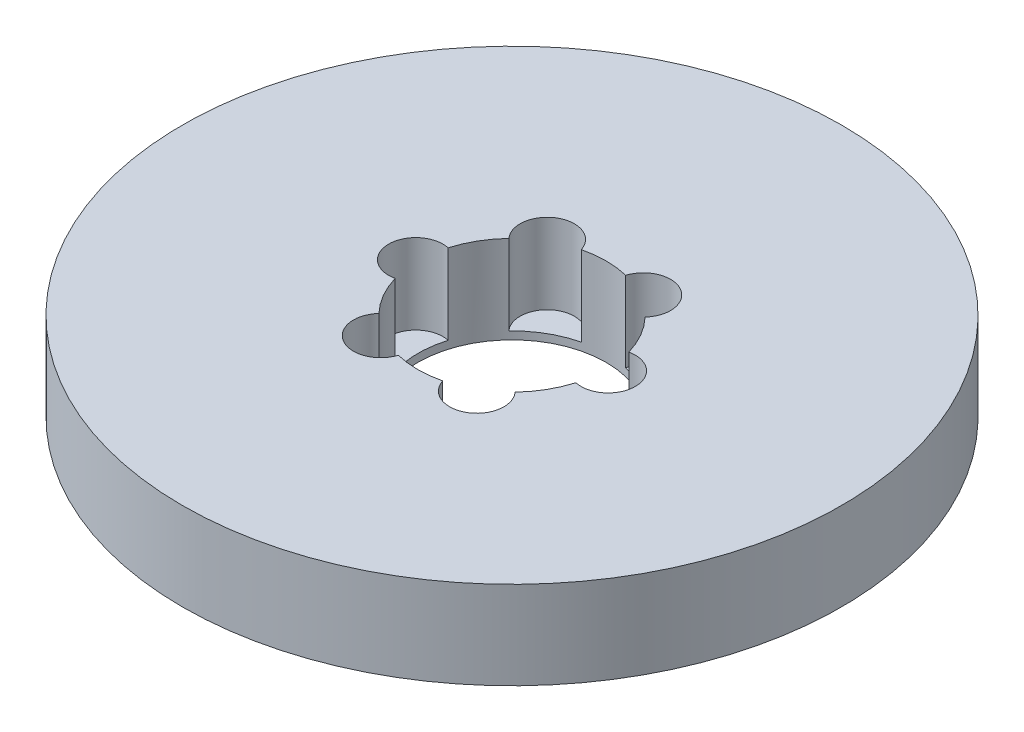
ISO-10303-21;
HEADER;
FILE_DESCRIPTION(('STEP AP214'),'2;1');
FILE_NAME('part.step','',(''),(''),'','','');
FILE_SCHEMA(('AUTOMOTIVE_DESIGN { 1 0 10303 214 1 1 1 1 }'));
ENDSEC;
DATA;
#1=APPLICATION_CONTEXT('core data for automotive mechanical design processes');
#2=APPLICATION_PROTOCOL_DEFINITION('international standard','automotive_design',2000,#1);
#3=PRODUCT_CONTEXT('',#1,'mechanical');
#4=PRODUCT('Part','Part','',(#3));
#5=PRODUCT_RELATED_PRODUCT_CATEGORY('part','',(#4));
#6=PRODUCT_DEFINITION_FORMATION('','',#4);
#7=PRODUCT_DEFINITION_CONTEXT('part definition',#1,'design');
#8=PRODUCT_DEFINITION('design','',#6,#7);
#9=PRODUCT_DEFINITION_SHAPE('','',#8);
#10=(LENGTH_UNIT() NAMED_UNIT(*) SI_UNIT(.MILLI.,.METRE.));
#11=(NAMED_UNIT(*) PLANE_ANGLE_UNIT() SI_UNIT($,.RADIAN.));
#12=(NAMED_UNIT(*) SI_UNIT($,.STERADIAN.) SOLID_ANGLE_UNIT());
#13=UNCERTAINTY_MEASURE_WITH_UNIT(LENGTH_MEASURE(1.E-05),#10,'distance_accuracy_value','');
#14=(GEOMETRIC_REPRESENTATION_CONTEXT(3) GLOBAL_UNCERTAINTY_ASSIGNED_CONTEXT((#13)) GLOBAL_UNIT_ASSIGNED_CONTEXT((#10,
#11,#12)) REPRESENTATION_CONTEXT('',''));
#15=CARTESIAN_POINT('',(0.,0.,0.));
#16=DIRECTION('',(0.,0.,1.));
#17=DIRECTION('',(1.,0.,0.));
#18=AXIS2_PLACEMENT_3D('',#15,#16,#17);
#19=CARTESIAN_POINT('',(0.,14.,0.));
#20=DIRECTION('',(0.,-1.,0.));
#21=DIRECTION('',(0.,0.,-1.));
#22=AXIS2_PLACEMENT_3D('',#19,#20,#21);
#23=CYLINDRICAL_SURFACE('',#22,52.5);
#24=CARTESIAN_POINT('',(0.,14.,0.));
#25=DIRECTION('',(0.,1.,0.));
#26=DIRECTION('',(0.,0.,1.));
#27=AXIS2_PLACEMENT_3D('',#24,#25,#26);
#28=CIRCLE('',#27,52.5);
#29=CARTESIAN_POINT('',(0.,14.,52.5));
#30=VERTEX_POINT('',#29);
#31=EDGE_CURVE('E171',#30,#30,#28,.T.);
#32=ORIENTED_EDGE('',*,*,#31,.F.);
#33=EDGE_LOOP('',(#32));
#34=FACE_BOUND('',#33,.T.);
#35=CARTESIAN_POINT('',(0.,0.,0.));
#36=DIRECTION('',(0.,1.,0.));
#37=DIRECTION('',(0.,0.,1.));
#38=AXIS2_PLACEMENT_3D('',#35,#36,#37);
#39=CIRCLE('',#38,52.5);
#40=CARTESIAN_POINT('',(0.,0.,52.5));
#41=VERTEX_POINT('',#40);
#42=EDGE_CURVE('E157',#41,#41,#39,.T.);
#43=ORIENTED_EDGE('',*,*,#42,.T.);
#44=EDGE_LOOP('',(#43));
#45=FACE_BOUND('',#44,.T.);
#46=ADVANCED_FACE('F39',(#34,#45),#23,.T.);
#47=CARTESIAN_POINT('',(0.,14.,0.));
#48=DIRECTION('',(0.,1.,0.));
#49=DIRECTION('',(0.,0.,1.));
#50=AXIS2_PLACEMENT_3D('',#47,#48,#49);
#51=PLANE('',#50);
#52=CARTESIAN_POINT('',(-7.66203575899495,14.,-13.2710352239885));
#53=DIRECTION('',(0.,1.,0.));
#54=DIRECTION('',(-0.866025403784433,0.,0.50000000000001));
#55=AXIS2_PLACEMENT_3D('',#52,#53,#54);
#56=CIRCLE('',#55,4.3228501146269);
#57=CARTESIAN_POINT('',(-3.54088439085148,14.,-14.5760810141349));
#58=VERTEX_POINT('',#57);
#59=CARTESIAN_POINT('',(-10.8528142504354,14.,-10.3545363414084));
#60=VERTEX_POINT('',#59);
#61=EDGE_CURVE('E214',#58,#60,#56,.T.);
#62=ORIENTED_EDGE('',*,*,#61,.F.);
#63=CARTESIAN_POINT('',(0.,14.,0.));
#64=DIRECTION('',(0.,1.,0.));
#65=DIRECTION('',(0.,0.,1.));
#66=AXIS2_PLACEMENT_3D('',#63,#64,#65);
#67=CIRCLE('',#66,15.);
#68=CARTESIAN_POINT('',(3.54088439085117,14.,-14.576081014135));
#69=VERTEX_POINT('',#68);
#70=EDGE_CURVE('E272',#69,#58,#67,.T.);
#71=ORIENTED_EDGE('',*,*,#70,.F.);
#72=CARTESIAN_POINT('',(7.66203575899467,14.,-13.2710352239886));
#73=DIRECTION('',(0.,1.,0.));
#74=DIRECTION('',(-0.866025403784443,0.,-0.499999999999992));
#75=AXIS2_PLACEMENT_3D('',#72,#73,#74);
#76=CIRCLE('',#75,4.3228501146269);
#77=CARTESIAN_POINT('',(10.8528142504352,14.,-10.3545363414086));
#78=VERTEX_POINT('',#77);
#79=EDGE_CURVE('E285',#78,#69,#76,.T.);
#80=ORIENTED_EDGE('',*,*,#79,.F.);
#81=CARTESIAN_POINT('',(14.3936986412866,14.,-4.22154467272646));
#82=VERTEX_POINT('',#81);
#83=EDGE_CURVE('E165',#82,#78,#67,.T.);
#84=ORIENTED_EDGE('',*,*,#83,.F.);
#85=CARTESIAN_POINT('',(15.3240715179896,14.,0.));
#86=DIRECTION('',(0.,1.,0.));
#87=DIRECTION('',(0.,0.,-1.));
#88=AXIS2_PLACEMENT_3D('',#85,#86,#87);
#89=CIRCLE('',#88,4.3228501146269);
#90=CARTESIAN_POINT('',(14.3936986412866,14.,4.22154467272646));
#91=VERTEX_POINT('',#90);
#92=EDGE_CURVE('E281',#91,#82,#89,.T.);
#93=ORIENTED_EDGE('',*,*,#92,.F.);
#94=CARTESIAN_POINT('',(10.8528142504353,14.,10.3545363414084));
#95=VERTEX_POINT('',#94);
#96=EDGE_CURVE('E160',#95,#91,#67,.T.);
#97=ORIENTED_EDGE('',*,*,#96,.F.);
#98=CARTESIAN_POINT('',(7.66203575899486,14.,13.2710352239885));
#99=DIRECTION('',(0.,1.,0.));
#100=DIRECTION('',(0.866025403784436,0.,-0.500000000000004));
#101=AXIS2_PLACEMENT_3D('',#98,#99,#100);
#102=CIRCLE('',#101,4.3228501146269);
#103=CARTESIAN_POINT('',(3.54088439085137,14.,14.5760810141349));
#104=VERTEX_POINT('',#103);
#105=EDGE_CURVE('E154',#104,#95,#102,.T.);
#106=ORIENTED_EDGE('',*,*,#105,.F.);
#107=CARTESIAN_POINT('',(-3.54088439085127,14.,14.576081014135));
#108=VERTEX_POINT('',#107);
#109=EDGE_CURVE('E150',#108,#104,#67,.T.);
#110=ORIENTED_EDGE('',*,*,#109,.F.);
#111=CARTESIAN_POINT('',(-7.66203575899477,14.,13.2710352239886));
#112=DIRECTION('',(0.,1.,0.));
#113=DIRECTION('',(0.86602540378444,0.,0.499999999999998));
#114=AXIS2_PLACEMENT_3D('',#111,#112,#113);
#115=CIRCLE('',#114,4.3228501146269);
#116=CARTESIAN_POINT('',(-10.8528142504352,14.,10.3545363414085));
#117=VERTEX_POINT('',#116);
#118=EDGE_CURVE('E127',#117,#108,#115,.T.);
#119=ORIENTED_EDGE('',*,*,#118,.F.);
#120=CARTESIAN_POINT('',(-14.3936986412866,14.,4.22154467272646));
#121=VERTEX_POINT('',#120);
#122=EDGE_CURVE('E156',#121,#117,#67,.T.);
#123=ORIENTED_EDGE('',*,*,#122,.F.);
#124=CARTESIAN_POINT('',(-15.3240715179896,14.,0.));
#125=DIRECTION('',(0.,1.,0.));
#126=DIRECTION('',(0.,0.,1.));
#127=AXIS2_PLACEMENT_3D('',#124,#125,#126);
#128=CIRCLE('',#127,4.3228501146269);
#129=CARTESIAN_POINT('',(-14.3936986412866,14.,-4.22154467272646));
#130=VERTEX_POINT('',#129);
#131=EDGE_CURVE('E164',#130,#121,#128,.T.);
#132=ORIENTED_EDGE('',*,*,#131,.F.);
#133=EDGE_CURVE('E159',#60,#130,#67,.T.);
#134=ORIENTED_EDGE('',*,*,#133,.F.);
#135=EDGE_LOOP('',(#62,#71,#80,#84,#93,#97,#106,#110,#119,#123,#132,#134));
#136=FACE_BOUND('',#135,.T.);
#137=ORIENTED_EDGE('',*,*,#31,.T.);
#138=EDGE_LOOP('',(#137));
#139=FACE_BOUND('',#138,.T.);
#140=ADVANCED_FACE('F155',(#136,#139),#51,.T.);
#141=CARTESIAN_POINT('',(0.,0.,0.));
#142=DIRECTION('',(0.,1.,0.));
#143=DIRECTION('',(0.,0.,1.));
#144=AXIS2_PLACEMENT_3D('',#141,#142,#143);
#145=PLANE('',#144);
#146=CARTESIAN_POINT('',(0.,0.,0.));
#147=DIRECTION('',(0.,1.,0.));
#148=DIRECTION('',(0.,0.,1.));
#149=AXIS2_PLACEMENT_3D('',#146,#147,#148);
#150=CIRCLE('',#149,15.);
#151=CARTESIAN_POINT('',(0.,0.,15.));
#152=VERTEX_POINT('',#151);
#153=EDGE_CURVE('E170',#152,#152,#150,.T.);
#154=ORIENTED_EDGE('',*,*,#153,.T.);
#155=EDGE_LOOP('',(#154));
#156=FACE_BOUND('',#155,.T.);
#157=ORIENTED_EDGE('',*,*,#42,.F.);
#158=EDGE_LOOP('',(#157));
#159=FACE_BOUND('',#158,.T.);
#160=ADVANCED_FACE('F232',(#156,#159),#145,.F.);
#161=CARTESIAN_POINT('',(0.,14.,0.));
#162=DIRECTION('',(0.,-1.,0.));
#163=DIRECTION('',(0.,0.,-1.));
#164=AXIS2_PLACEMENT_3D('',#161,#162,#163);
#165=CYLINDRICAL_SURFACE('',#164,15.);
#166=DIRECTION('',(0.,1.,0.));
#167=VECTOR('',#166,1.);
#168=CARTESIAN_POINT('',(-3.54088439085147,7.62012158339017,-14.5760810141349));
#169=LINE('',#168,#167);
#170=CARTESIAN_POINT('',(-3.54088439085148,1.24024316678033,-14.5760810141349));
#171=VERTEX_POINT('',#170);
#172=EDGE_CURVE('E11',#171,#58,#169,.T.);
#173=ORIENTED_EDGE('',*,*,#172,.F.);
#174=CARTESIAN_POINT('',(0.,1.24024316678033,0.));
#175=DIRECTION('',(0.,1.,0.));
#176=DIRECTION('',(0.,0.,1.));
#177=AXIS2_PLACEMENT_3D('',#174,#175,#176);
#178=CIRCLE('',#177,15.);
#179=CARTESIAN_POINT('',(-10.8528142504354,1.24024316678033,-10.3545363414084));
#180=VERTEX_POINT('',#179);
#181=EDGE_CURVE('E209',#171,#180,#178,.T.);
#182=ORIENTED_EDGE('',*,*,#181,.T.);
#183=DIRECTION('',(0.,1.,0.));
#184=VECTOR('',#183,1.);
#185=CARTESIAN_POINT('',(-10.8528142504354,7.62012158339017,-10.3545363414084));
#186=LINE('',#185,#184);
#187=EDGE_CURVE('E46',#60,#180,#186,.F.);
#188=ORIENTED_EDGE('',*,*,#187,.F.);
#189=ORIENTED_EDGE('',*,*,#133,.T.);
#190=DIRECTION('',(0.,1.,0.));
#191=VECTOR('',#190,1.);
#192=CARTESIAN_POINT('',(-14.3936986412866,7.62012158339017,-4.22154467272646));
#193=LINE('',#192,#191);
#194=CARTESIAN_POINT('',(-14.3936986412866,1.24024316678033,-4.22154467272646));
#195=VERTEX_POINT('',#194);
#196=EDGE_CURVE('E185',#195,#130,#193,.T.);
#197=ORIENTED_EDGE('',*,*,#196,.F.);
#198=CARTESIAN_POINT('',(0.,1.24024316678033,0.));
#199=DIRECTION('',(0.,1.,0.));
#200=DIRECTION('',(0.,0.,1.));
#201=AXIS2_PLACEMENT_3D('',#198,#199,#200);
#202=CIRCLE('',#201,15.);
#203=CARTESIAN_POINT('',(-14.3936986412866,1.24024316678033,4.22154467272646));
#204=VERTEX_POINT('',#203);
#205=EDGE_CURVE('E173',#195,#204,#202,.T.);
#206=ORIENTED_EDGE('',*,*,#205,.T.);
#207=DIRECTION('',(0.,1.,0.));
#208=VECTOR('',#207,1.);
#209=CARTESIAN_POINT('',(-14.3936986412866,7.62012158339017,4.22154467272646));
#210=LINE('',#209,#208);
#211=EDGE_CURVE('E178',#121,#204,#210,.F.);
#212=ORIENTED_EDGE('',*,*,#211,.F.);
#213=ORIENTED_EDGE('',*,*,#122,.T.);
#214=DIRECTION('',(0.,1.,0.));
#215=VECTOR('',#214,1.);
#216=CARTESIAN_POINT('',(-10.8528142504352,7.62012158339017,10.3545363414085));
#217=LINE('',#216,#215);
#218=CARTESIAN_POINT('',(-10.8528142504352,1.24024316678033,10.3545363414085));
#219=VERTEX_POINT('',#218);
#220=EDGE_CURVE('E132',#219,#117,#217,.T.);
#221=ORIENTED_EDGE('',*,*,#220,.F.);
#222=CARTESIAN_POINT('',(0.,1.24024316678033,0.));
#223=DIRECTION('',(0.,1.,0.));
#224=DIRECTION('',(0.,0.,1.));
#225=AXIS2_PLACEMENT_3D('',#222,#223,#224);
#226=CIRCLE('',#225,15.);
#227=CARTESIAN_POINT('',(-3.54088439085127,1.24024316678033,14.576081014135));
#228=VERTEX_POINT('',#227);
#229=EDGE_CURVE('E146',#219,#228,#226,.T.);
#230=ORIENTED_EDGE('',*,*,#229,.T.);
#231=DIRECTION('',(0.,1.,0.));
#232=VECTOR('',#231,1.);
#233=CARTESIAN_POINT('',(-3.54088439085127,7.62012158339017,14.576081014135));
#234=LINE('',#233,#232);
#235=EDGE_CURVE('E128',#108,#228,#234,.F.);
#236=ORIENTED_EDGE('',*,*,#235,.F.);
#237=ORIENTED_EDGE('',*,*,#109,.T.);
#238=DIRECTION('',(0.,1.,0.));
#239=VECTOR('',#238,1.);
#240=CARTESIAN_POINT('',(3.54088439085137,7.62012158339017,14.5760810141349));
#241=LINE('',#240,#239);
#242=CARTESIAN_POINT('',(3.54088439085137,1.24024316678033,14.5760810141349));
#243=VERTEX_POINT('',#242);
#244=EDGE_CURVE('E192',#243,#104,#241,.T.);
#245=ORIENTED_EDGE('',*,*,#244,.F.);
#246=CARTESIAN_POINT('',(0.,1.24024316678033,0.));
#247=DIRECTION('',(0.,1.,0.));
#248=DIRECTION('',(0.,0.,1.));
#249=AXIS2_PLACEMENT_3D('',#246,#247,#248);
#250=CIRCLE('',#249,15.);
#251=CARTESIAN_POINT('',(10.8528142504353,1.24024316678033,10.3545363414084));
#252=VERTEX_POINT('',#251);
#253=EDGE_CURVE('E190',#243,#252,#250,.T.);
#254=ORIENTED_EDGE('',*,*,#253,.T.);
#255=DIRECTION('',(0.,1.,0.));
#256=VECTOR('',#255,1.);
#257=CARTESIAN_POINT('',(10.8528142504353,7.62012158339017,10.3545363414084));
#258=LINE('',#257,#256);
#259=EDGE_CURVE('E189',#95,#252,#258,.F.);
#260=ORIENTED_EDGE('',*,*,#259,.F.);
#261=ORIENTED_EDGE('',*,*,#96,.T.);
#262=DIRECTION('',(0.,1.,0.));
#263=VECTOR('',#262,1.);
#264=CARTESIAN_POINT('',(14.3936986412866,7.62012158339017,4.22154467272646));
#265=LINE('',#264,#263);
#266=CARTESIAN_POINT('',(14.3936986412866,1.24024316678033,4.22154467272646));
#267=VERTEX_POINT('',#266);
#268=EDGE_CURVE('E203',#267,#91,#265,.T.);
#269=ORIENTED_EDGE('',*,*,#268,.F.);
#270=CARTESIAN_POINT('',(0.,1.24024316678033,0.));
#271=DIRECTION('',(0.,1.,0.));
#272=DIRECTION('',(0.,0.,1.));
#273=AXIS2_PLACEMENT_3D('',#270,#271,#272);
#274=CIRCLE('',#273,15.);
#275=CARTESIAN_POINT('',(14.3936986412866,1.24024316678033,-4.22154467272646));
#276=VERTEX_POINT('',#275);
#277=EDGE_CURVE('E194',#267,#276,#274,.T.);
#278=ORIENTED_EDGE('',*,*,#277,.T.);
#279=DIRECTION('',(0.,1.,0.));
#280=VECTOR('',#279,1.);
#281=CARTESIAN_POINT('',(14.3936986412866,7.62012158339017,-4.22154467272646));
#282=LINE('',#281,#280);
#283=EDGE_CURVE('E196',#82,#276,#282,.F.);
#284=ORIENTED_EDGE('',*,*,#283,.F.);
#285=ORIENTED_EDGE('',*,*,#83,.T.);
#286=DIRECTION('',(0.,1.,0.));
#287=VECTOR('',#286,1.);
#288=CARTESIAN_POINT('',(10.8528142504352,7.62012158339017,-10.3545363414086));
#289=LINE('',#288,#287);
#290=CARTESIAN_POINT('',(10.8528142504352,1.24024316678033,-10.3545363414086));
#291=VERTEX_POINT('',#290);
#292=EDGE_CURVE('E208',#291,#78,#289,.T.);
#293=ORIENTED_EDGE('',*,*,#292,.F.);
#294=CARTESIAN_POINT('',(0.,1.24024316678033,0.));
#295=DIRECTION('',(0.,1.,0.));
#296=DIRECTION('',(0.,0.,1.));
#297=AXIS2_PLACEMENT_3D('',#294,#295,#296);
#298=CIRCLE('',#297,15.);
#299=CARTESIAN_POINT('',(3.54088439085117,1.24024316678033,-14.576081014135));
#300=VERTEX_POINT('',#299);
#301=EDGE_CURVE('E201',#291,#300,#298,.T.);
#302=ORIENTED_EDGE('',*,*,#301,.T.);
#303=DIRECTION('',(0.,1.,0.));
#304=VECTOR('',#303,1.);
#305=CARTESIAN_POINT('',(3.54088439085117,7.62012158339017,-14.576081014135));
#306=LINE('',#305,#304);
#307=EDGE_CURVE('E206',#69,#300,#306,.F.);
#308=ORIENTED_EDGE('',*,*,#307,.F.);
#309=ORIENTED_EDGE('',*,*,#70,.T.);
#310=EDGE_LOOP('',(#173,#182,#188,#189,#197,#206,#212,#213,#221,#230,#236,#237,#245,#254,#260,
#261,#269,#278,#284,#285,#293,#302,#308,#309));
#311=FACE_BOUND('',#310,.T.);
#312=ORIENTED_EDGE('',*,*,#153,.F.);
#313=EDGE_LOOP('',(#312));
#314=FACE_BOUND('',#313,.T.);
#315=ADVANCED_FACE('F145',(#311,#314),#165,.F.);
#316=CARTESIAN_POINT('',(-15.3240715179896,1.24024316678033,0.));
#317=DIRECTION('',(0.,1.,0.));
#318=DIRECTION('',(0.,0.,1.));
#319=AXIS2_PLACEMENT_3D('',#316,#317,#318);
#320=CYLINDRICAL_SURFACE('',#319,4.3228501146269);
#321=ORIENTED_EDGE('',*,*,#196,.T.);
#322=ORIENTED_EDGE('',*,*,#131,.T.);
#323=ORIENTED_EDGE('',*,*,#211,.T.);
#324=CARTESIAN_POINT('',(-15.3240715179896,1.24024316678033,0.));
#325=DIRECTION('',(0.,1.,0.));
#326=DIRECTION('',(0.,0.,1.));
#327=AXIS2_PLACEMENT_3D('',#324,#325,#326);
#328=CIRCLE('',#327,4.3228501146269);
#329=EDGE_CURVE('E168',#195,#204,#328,.T.);
#330=ORIENTED_EDGE('',*,*,#329,.F.);
#331=EDGE_LOOP('',(#321,#322,#323,#330));
#332=FACE_BOUND('',#331,.T.);
#333=ADVANCED_FACE('F243',(#332),#320,.F.);
#334=CARTESIAN_POINT('',(-15.3240715179896,1.24024316678033,0.));
#335=DIRECTION('',(0.,1.,0.));
#336=DIRECTION('',(0.,0.,1.));
#337=AXIS2_PLACEMENT_3D('',#334,#335,#336);
#338=PLANE('',#337);
#339=ORIENTED_EDGE('',*,*,#329,.T.);
#340=ORIENTED_EDGE('',*,*,#205,.F.);
#341=EDGE_LOOP('',(#339,#340));
#342=FACE_BOUND('',#341,.T.);
#343=ADVANCED_FACE('F247',(#342),#338,.T.);
#344=CARTESIAN_POINT('',(-7.66203575899477,1.24024316678033,13.2710352239886));
#345=DIRECTION('',(0.,1.,0.));
#346=DIRECTION('',(0.,0.,1.));
#347=AXIS2_PLACEMENT_3D('',#344,#345,#346);
#348=CYLINDRICAL_SURFACE('',#347,4.3228501146269);
#349=ORIENTED_EDGE('',*,*,#220,.T.);
#350=ORIENTED_EDGE('',*,*,#118,.T.);
#351=ORIENTED_EDGE('',*,*,#235,.T.);
#352=CARTESIAN_POINT('',(-7.66203575899477,1.24024316678033,13.2710352239886));
#353=DIRECTION('',(0.,1.,0.));
#354=DIRECTION('',(0.86602540378444,0.,0.499999999999998));
#355=AXIS2_PLACEMENT_3D('',#352,#353,#354);
#356=CIRCLE('',#355,4.3228501146269);
#357=EDGE_CURVE('E137',#219,#228,#356,.T.);
#358=ORIENTED_EDGE('',*,*,#357,.F.);
#359=EDGE_LOOP('',(#349,#350,#351,#358));
#360=FACE_BOUND('',#359,.T.);
#361=ADVANCED_FACE('F126',(#360),#348,.F.);
#362=CARTESIAN_POINT('',(-7.66203575899477,1.24024316678033,13.2710352239886));
#363=DIRECTION('',(0.,1.,0.));
#364=DIRECTION('',(0.86602540378444,0.,0.499999999999998));
#365=AXIS2_PLACEMENT_3D('',#362,#363,#364);
#366=PLANE('',#365);
#367=ORIENTED_EDGE('',*,*,#357,.T.);
#368=ORIENTED_EDGE('',*,*,#229,.F.);
#369=EDGE_LOOP('',(#367,#368));
#370=FACE_BOUND('',#369,.T.);
#371=ADVANCED_FACE('F254',(#370),#366,.T.);
#372=CARTESIAN_POINT('',(7.66203575899486,1.24024316678033,13.2710352239885));
#373=DIRECTION('',(0.,1.,0.));
#374=DIRECTION('',(0.,0.,1.));
#375=AXIS2_PLACEMENT_3D('',#372,#373,#374);
#376=CYLINDRICAL_SURFACE('',#375,4.3228501146269);
#377=ORIENTED_EDGE('',*,*,#244,.T.);
#378=ORIENTED_EDGE('',*,*,#105,.T.);
#379=ORIENTED_EDGE('',*,*,#259,.T.);
#380=CARTESIAN_POINT('',(7.66203575899486,1.24024316678033,13.2710352239885));
#381=DIRECTION('',(0.,1.,0.));
#382=DIRECTION('',(0.866025403784436,0.,-0.500000000000004));
#383=AXIS2_PLACEMENT_3D('',#380,#381,#382);
#384=CIRCLE('',#383,4.3228501146269);
#385=EDGE_CURVE('E138',#243,#252,#384,.T.);
#386=ORIENTED_EDGE('',*,*,#385,.F.);
#387=EDGE_LOOP('',(#377,#378,#379,#386));
#388=FACE_BOUND('',#387,.T.);
#389=ADVANCED_FACE('F260',(#388),#376,.F.);
#390=CARTESIAN_POINT('',(7.66203575899486,1.24024316678033,13.2710352239885));
#391=DIRECTION('',(0.,1.,0.));
#392=DIRECTION('',(0.866025403784436,0.,-0.500000000000004));
#393=AXIS2_PLACEMENT_3D('',#390,#391,#392);
#394=PLANE('',#393);
#395=ORIENTED_EDGE('',*,*,#385,.T.);
#396=ORIENTED_EDGE('',*,*,#253,.F.);
#397=EDGE_LOOP('',(#395,#396));
#398=FACE_BOUND('',#397,.T.);
#399=ADVANCED_FACE('F265',(#398),#394,.T.);
#400=CARTESIAN_POINT('',(15.3240715179896,1.24024316678033,0.));
#401=DIRECTION('',(0.,1.,0.));
#402=DIRECTION('',(0.,0.,1.));
#403=AXIS2_PLACEMENT_3D('',#400,#401,#402);
#404=CYLINDRICAL_SURFACE('',#403,4.3228501146269);
#405=ORIENTED_EDGE('',*,*,#268,.T.);
#406=ORIENTED_EDGE('',*,*,#92,.T.);
#407=ORIENTED_EDGE('',*,*,#283,.T.);
#408=CARTESIAN_POINT('',(15.3240715179896,1.24024316678033,0.));
#409=DIRECTION('',(0.,1.,0.));
#410=DIRECTION('',(0.,0.,-1.));
#411=AXIS2_PLACEMENT_3D('',#408,#409,#410);
#412=CIRCLE('',#411,4.3228501146269);
#413=EDGE_CURVE('E287',#267,#276,#412,.T.);
#414=ORIENTED_EDGE('',*,*,#413,.F.);
#415=EDGE_LOOP('',(#405,#406,#407,#414));
#416=FACE_BOUND('',#415,.T.);
#417=ADVANCED_FACE('F300',(#416),#404,.F.);
#418=CARTESIAN_POINT('',(15.3240715179896,1.24024316678033,0.));
#419=DIRECTION('',(0.,1.,0.));
#420=DIRECTION('',(0.,0.,-1.));
#421=AXIS2_PLACEMENT_3D('',#418,#419,#420);
#422=PLANE('',#421);
#423=ORIENTED_EDGE('',*,*,#413,.T.);
#424=ORIENTED_EDGE('',*,*,#277,.F.);
#425=EDGE_LOOP('',(#423,#424));
#426=FACE_BOUND('',#425,.T.);
#427=ADVANCED_FACE('F298',(#426),#422,.T.);
#428=CARTESIAN_POINT('',(7.66203575899467,1.24024316678033,-13.2710352239886));
#429=DIRECTION('',(0.,1.,0.));
#430=DIRECTION('',(0.,0.,1.));
#431=AXIS2_PLACEMENT_3D('',#428,#429,#430);
#432=CYLINDRICAL_SURFACE('',#431,4.3228501146269);
#433=ORIENTED_EDGE('',*,*,#292,.T.);
#434=ORIENTED_EDGE('',*,*,#79,.T.);
#435=ORIENTED_EDGE('',*,*,#307,.T.);
#436=CARTESIAN_POINT('',(7.66203575899467,1.24024316678033,-13.2710352239886));
#437=DIRECTION('',(0.,1.,0.));
#438=DIRECTION('',(-0.866025403784443,0.,-0.499999999999992));
#439=AXIS2_PLACEMENT_3D('',#436,#437,#438);
#440=CIRCLE('',#439,4.3228501146269);
#441=EDGE_CURVE('E56',#291,#300,#440,.T.);
#442=ORIENTED_EDGE('',*,*,#441,.F.);
#443=EDGE_LOOP('',(#433,#434,#435,#442));
#444=FACE_BOUND('',#443,.T.);
#445=ADVANCED_FACE('F301',(#444),#432,.F.);
#446=CARTESIAN_POINT('',(7.66203575899467,1.24024316678033,-13.2710352239886));
#447=DIRECTION('',(0.,1.,0.));
#448=DIRECTION('',(-0.866025403784443,0.,-0.499999999999992));
#449=AXIS2_PLACEMENT_3D('',#446,#447,#448);
#450=PLANE('',#449);
#451=ORIENTED_EDGE('',*,*,#441,.T.);
#452=ORIENTED_EDGE('',*,*,#301,.F.);
#453=EDGE_LOOP('',(#451,#452));
#454=FACE_BOUND('',#453,.T.);
#455=ADVANCED_FACE('F221',(#454),#450,.T.);
#456=CARTESIAN_POINT('',(-7.66203575899495,1.24024316678033,-13.2710352239885));
#457=DIRECTION('',(0.,1.,0.));
#458=DIRECTION('',(0.,0.,1.));
#459=AXIS2_PLACEMENT_3D('',#456,#457,#458);
#460=CYLINDRICAL_SURFACE('',#459,4.3228501146269);
#461=ORIENTED_EDGE('',*,*,#172,.T.);
#462=ORIENTED_EDGE('',*,*,#61,.T.);
#463=ORIENTED_EDGE('',*,*,#187,.T.);
#464=CARTESIAN_POINT('',(-7.66203575899495,1.24024316678033,-13.2710352239885));
#465=DIRECTION('',(0.,1.,0.));
#466=DIRECTION('',(-0.866025403784433,0.,0.50000000000001));
#467=AXIS2_PLACEMENT_3D('',#464,#465,#466);
#468=CIRCLE('',#467,4.3228501146269);
#469=EDGE_CURVE('E55',#171,#180,#468,.T.);
#470=ORIENTED_EDGE('',*,*,#469,.F.);
#471=EDGE_LOOP('',(#461,#462,#463,#470));
#472=FACE_BOUND('',#471,.T.);
#473=ADVANCED_FACE('F212',(#472),#460,.F.);
#474=CARTESIAN_POINT('',(-7.66203575899495,1.24024316678033,-13.2710352239885));
#475=DIRECTION('',(0.,1.,0.));
#476=DIRECTION('',(-0.866025403784433,0.,0.50000000000001));
#477=AXIS2_PLACEMENT_3D('',#474,#475,#476);
#478=PLANE('',#477);
#479=ORIENTED_EDGE('',*,*,#469,.T.);
#480=ORIENTED_EDGE('',*,*,#181,.F.);
#481=EDGE_LOOP('',(#479,#480));
#482=FACE_BOUND('',#481,.T.);
#483=ADVANCED_FACE('F217',(#482),#478,.T.);
#484=CLOSED_SHELL('',(#46,#140,#160,#315,#333,#343,#361,#371,#389,#399,#417,#427,#445,#455,#473,#483));
#485=MANIFOLD_SOLID_BREP('B2',#484);
#486=ADVANCED_BREP_SHAPE_REPRESENTATION('',(#18,#485),#14);
#487=SHAPE_DEFINITION_REPRESENTATION(#9,#486);
ENDSEC;
END-ISO-10303-21;
